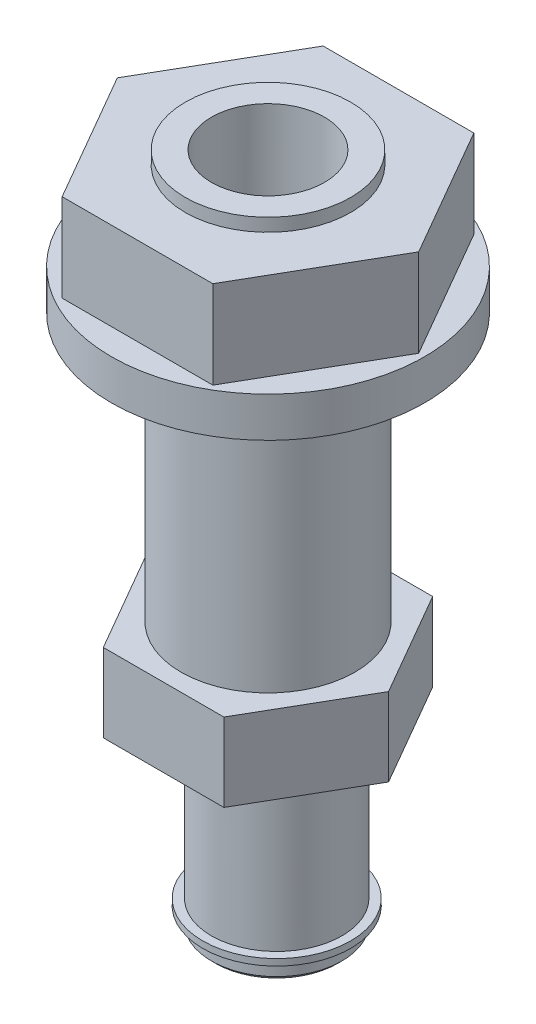
ISO-10303-21;
HEADER;
FILE_DESCRIPTION(('STEP AP214'),'2;1');
FILE_NAME('part.step','',(''),(''),'','','');
FILE_SCHEMA(('AUTOMOTIVE_DESIGN { 1 0 10303 214 1 1 1 1 }'));
ENDSEC;
DATA;
#1=APPLICATION_CONTEXT('core data for automotive mechanical design processes');
#2=APPLICATION_PROTOCOL_DEFINITION('international standard','automotive_design',2000,#1);
#3=PRODUCT_CONTEXT('',#1,'mechanical');
#4=PRODUCT('Part','Part','',(#3));
#5=PRODUCT_RELATED_PRODUCT_CATEGORY('part','',(#4));
#6=PRODUCT_DEFINITION_FORMATION('','',#4);
#7=PRODUCT_DEFINITION_CONTEXT('part definition',#1,'design');
#8=PRODUCT_DEFINITION('design','',#6,#7);
#9=PRODUCT_DEFINITION_SHAPE('','',#8);
#10=(LENGTH_UNIT() NAMED_UNIT(*) SI_UNIT(.MILLI.,.METRE.));
#11=(NAMED_UNIT(*) PLANE_ANGLE_UNIT() SI_UNIT($,.RADIAN.));
#12=(NAMED_UNIT(*) SI_UNIT($,.STERADIAN.) SOLID_ANGLE_UNIT());
#13=UNCERTAINTY_MEASURE_WITH_UNIT(LENGTH_MEASURE(1.E-05),#10,'distance_accuracy_value','');
#14=(GEOMETRIC_REPRESENTATION_CONTEXT(3) GLOBAL_UNCERTAINTY_ASSIGNED_CONTEXT((#13)) GLOBAL_UNIT_ASSIGNED_CONTEXT((#10,
#11,#12)) REPRESENTATION_CONTEXT('',''));
#15=CARTESIAN_POINT('',(0.,0.,0.));
#16=DIRECTION('',(0.,0.,1.));
#17=DIRECTION('',(1.,0.,0.));
#18=AXIS2_PLACEMENT_3D('',#15,#16,#17);
#19=CARTESIAN_POINT('',(-18.3343741873701,44.4,18.));
#20=DIRECTION('',(0.,1.,0.));
#21=DIRECTION('',(1.,0.,0.));
#22=AXIS2_PLACEMENT_3D('',#19,#20,#21);
#23=PLANE('',#22);
#24=CARTESIAN_POINT('',(0.,44.4,0.));
#25=DIRECTION('',(0.,1.,0.));
#26=DIRECTION('',(0.,0.,-1.));
#27=AXIS2_PLACEMENT_3D('',#24,#25,#26);
#28=CIRCLE('',#27,18.);
#29=CARTESIAN_POINT('',(0.,44.4,-18.));
#30=VERTEX_POINT('',#29);
#31=EDGE_CURVE('E128',#30,#30,#28,.F.);
#32=ORIENTED_EDGE('',*,*,#31,.F.);
#33=EDGE_LOOP('',(#32));
#34=FACE_BOUND('',#33,.T.);
#35=DIRECTION('',(0.500000000000009,0.,-0.866025403784433));
#36=VECTOR('',#35,1.);
#37=CARTESIAN_POINT('',(-17.320508075689,44.4,0.));
#38=LINE('',#37,#36);
#39=CARTESIAN_POINT('',(-8.6602540378444,44.4,-15.));
#40=VERTEX_POINT('',#39);
#41=CARTESIAN_POINT('',(-17.320508075689,44.4,0.));
#42=VERTEX_POINT('',#41);
#43=EDGE_CURVE('E114',#40,#42,#38,.F.);
#44=ORIENTED_EDGE('',*,*,#43,.F.);
#45=DIRECTION('',(1.,0.,0.));
#46=VECTOR('',#45,1.);
#47=CARTESIAN_POINT('',(-8.6602540378444,44.4,-15.));
#48=LINE('',#47,#46);
#49=CARTESIAN_POINT('',(8.66025403784441,44.4,-15.));
#50=VERTEX_POINT('',#49);
#51=EDGE_CURVE('E103',#50,#40,#48,.F.);
#52=ORIENTED_EDGE('',*,*,#51,.F.);
#53=DIRECTION('',(0.50000000000001,0.,0.866025403784433));
#54=VECTOR('',#53,1.);
#55=CARTESIAN_POINT('',(8.6602540378444,44.4,-15.));
#56=LINE('',#55,#54);
#57=CARTESIAN_POINT('',(17.320508075689,44.4,0.));
#58=VERTEX_POINT('',#57);
#59=EDGE_CURVE('E113',#58,#50,#56,.F.);
#60=ORIENTED_EDGE('',*,*,#59,.F.);
#61=DIRECTION('',(-0.500000000000009,0.,0.866025403784433));
#62=VECTOR('',#61,1.);
#63=CARTESIAN_POINT('',(17.320508075689,44.4,0.));
#64=LINE('',#63,#62);
#65=CARTESIAN_POINT('',(8.6602540378444,44.4,15.));
#66=VERTEX_POINT('',#65);
#67=EDGE_CURVE('E138',#66,#58,#64,.F.);
#68=ORIENTED_EDGE('',*,*,#67,.F.);
#69=DIRECTION('',(-1.,0.,0.));
#70=VECTOR('',#69,1.);
#71=CARTESIAN_POINT('',(8.6602540378444,44.4,15.));
#72=LINE('',#71,#70);
#73=CARTESIAN_POINT('',(-8.6602540378444,44.4,15.));
#74=VERTEX_POINT('',#73);
#75=EDGE_CURVE('E143',#74,#66,#72,.F.);
#76=ORIENTED_EDGE('',*,*,#75,.F.);
#77=DIRECTION('',(-0.500000000000009,0.,-0.866025403784433));
#78=VECTOR('',#77,1.);
#79=CARTESIAN_POINT('',(-8.6602540378444,44.4,15.));
#80=LINE('',#79,#78);
#81=EDGE_CURVE('E127',#42,#74,#80,.F.);
#82=ORIENTED_EDGE('',*,*,#81,.F.);
#83=EDGE_LOOP('',(#44,#52,#60,#68,#76,#82));
#84=FACE_BOUND('',#83,.T.);
#85=ADVANCED_FACE('F16',(#34,#84),#23,.T.);
#86=CARTESIAN_POINT('',(-13.856406460551,0.,0.));
#87=DIRECTION('',(-0.866025403784439,0.,-0.5));
#88=DIRECTION('',(0.,1.,0.));
#89=AXIS2_PLACEMENT_3D('',#86,#87,#88);
#90=PLANE('',#89);
#91=DIRECTION('',(-0.5,0.,0.866025403784439));
#92=VECTOR('',#91,1.);
#93=CARTESIAN_POINT('',(-6.9282032302755,0.,-12.));
#94=LINE('',#93,#92);
#95=CARTESIAN_POINT('',(-6.9282032302755,0.,-12.));
#96=VERTEX_POINT('',#95);
#97=CARTESIAN_POINT('',(-13.856406460551,0.,0.));
#98=VERTEX_POINT('',#97);
#99=EDGE_CURVE('E151',#96,#98,#94,.T.);
#100=ORIENTED_EDGE('',*,*,#99,.T.);
#101=DIRECTION('',(0.,1.,0.));
#102=VECTOR('',#101,1.);
#103=CARTESIAN_POINT('',(-13.856406460551,0.,0.));
#104=LINE('',#103,#102);
#105=CARTESIAN_POINT('',(-13.856406460551,9.,0.));
#106=VERTEX_POINT('',#105);
#107=EDGE_CURVE('E156',#106,#98,#104,.F.);
#108=ORIENTED_EDGE('',*,*,#107,.F.);
#109=DIRECTION('',(0.5,0.,-0.866025403784439));
#110=VECTOR('',#109,1.);
#111=CARTESIAN_POINT('',(-13.856406460551,9.,0.));
#112=LINE('',#111,#110);
#113=CARTESIAN_POINT('',(-6.9282032302755,9.,-12.));
#114=VERTEX_POINT('',#113);
#115=EDGE_CURVE('E161',#114,#106,#112,.F.);
#116=ORIENTED_EDGE('',*,*,#115,.F.);
#117=DIRECTION('',(0.,-1.,0.));
#118=VECTOR('',#117,1.);
#119=CARTESIAN_POINT('',(-6.9282032302755,9.,-12.));
#120=LINE('',#119,#118);
#121=EDGE_CURVE('E165',#114,#96,#120,.T.);
#122=ORIENTED_EDGE('',*,*,#121,.T.);
#123=EDGE_LOOP('',(#100,#108,#116,#122));
#124=FACE_BOUND('',#123,.T.);
#125=ADVANCED_FACE('F344',(#124),#90,.T.);
#126=CARTESIAN_POINT('',(-6.9282032302755,0.,12.));
#127=DIRECTION('',(-0.866025403784439,0.,0.5));
#128=DIRECTION('',(0.,1.,0.));
#129=AXIS2_PLACEMENT_3D('',#126,#127,#128);
#130=PLANE('',#129);
#131=DIRECTION('',(0.5,0.,0.866025403784439));
#132=VECTOR('',#131,1.);
#133=CARTESIAN_POINT('',(-13.856406460551,0.,0.));
#134=LINE('',#133,#132);
#135=CARTESIAN_POINT('',(-6.9282032302755,0.,12.));
#136=VERTEX_POINT('',#135);
#137=EDGE_CURVE('E170',#98,#136,#134,.T.);
#138=ORIENTED_EDGE('',*,*,#137,.T.);
#139=DIRECTION('',(0.,1.,0.));
#140=VECTOR('',#139,1.);
#141=CARTESIAN_POINT('',(-6.9282032302755,0.,12.));
#142=LINE('',#141,#140);
#143=CARTESIAN_POINT('',(-6.9282032302755,9.,12.));
#144=VERTEX_POINT('',#143);
#145=EDGE_CURVE('E175',#144,#136,#142,.F.);
#146=ORIENTED_EDGE('',*,*,#145,.F.);
#147=DIRECTION('',(-0.5,0.,-0.866025403784439));
#148=VECTOR('',#147,1.);
#149=CARTESIAN_POINT('',(-6.9282032302755,9.,12.));
#150=LINE('',#149,#148);
#151=EDGE_CURVE('E180',#106,#144,#150,.F.);
#152=ORIENTED_EDGE('',*,*,#151,.F.);
#153=ORIENTED_EDGE('',*,*,#107,.T.);
#154=EDGE_LOOP('',(#138,#146,#152,#153));
#155=FACE_BOUND('',#154,.T.);
#156=ADVANCED_FACE('F350',(#155),#130,.T.);
#157=CARTESIAN_POINT('',(6.9282032302755,0.,12.));
#158=DIRECTION('',(0.,0.,1.));
#159=DIRECTION('',(0.,1.,0.));
#160=AXIS2_PLACEMENT_3D('',#157,#158,#159);
#161=PLANE('',#160);
#162=DIRECTION('',(1.,0.,0.));
#163=VECTOR('',#162,1.);
#164=CARTESIAN_POINT('',(-6.9282032302755,0.,12.));
#165=LINE('',#164,#163);
#166=CARTESIAN_POINT('',(6.9282032302755,0.,12.));
#167=VERTEX_POINT('',#166);
#168=EDGE_CURVE('E184',#136,#167,#165,.T.);
#169=ORIENTED_EDGE('',*,*,#168,.T.);
#170=DIRECTION('',(0.,1.,0.));
#171=VECTOR('',#170,1.);
#172=CARTESIAN_POINT('',(6.9282032302755,0.,12.));
#173=LINE('',#172,#171);
#174=CARTESIAN_POINT('',(6.9282032302755,9.,12.));
#175=VERTEX_POINT('',#174);
#176=EDGE_CURVE('E189',#175,#167,#173,.F.);
#177=ORIENTED_EDGE('',*,*,#176,.F.);
#178=DIRECTION('',(-1.,0.,0.));
#179=VECTOR('',#178,1.);
#180=CARTESIAN_POINT('',(6.9282032302755,9.,12.));
#181=LINE('',#180,#179);
#182=EDGE_CURVE('E194',#144,#175,#181,.F.);
#183=ORIENTED_EDGE('',*,*,#182,.F.);
#184=ORIENTED_EDGE('',*,*,#145,.T.);
#185=EDGE_LOOP('',(#169,#177,#183,#184));
#186=FACE_BOUND('',#185,.T.);
#187=ADVANCED_FACE('F357',(#186),#161,.T.);
#188=CARTESIAN_POINT('',(13.856406460551,0.,0.));
#189=DIRECTION('',(0.866025403784439,0.,0.5));
#190=DIRECTION('',(0.,1.,0.));
#191=AXIS2_PLACEMENT_3D('',#188,#189,#190);
#192=PLANE('',#191);
#193=DIRECTION('',(0.5,0.,-0.866025403784439));
#194=VECTOR('',#193,1.);
#195=CARTESIAN_POINT('',(6.9282032302755,0.,12.));
#196=LINE('',#195,#194);
#197=CARTESIAN_POINT('',(13.856406460551,0.,0.));
#198=VERTEX_POINT('',#197);
#199=EDGE_CURVE('E198',#167,#198,#196,.T.);
#200=ORIENTED_EDGE('',*,*,#199,.T.);
#201=DIRECTION('',(0.,1.,0.));
#202=VECTOR('',#201,1.);
#203=CARTESIAN_POINT('',(13.856406460551,0.,0.));
#204=LINE('',#203,#202);
#205=CARTESIAN_POINT('',(13.856406460551,9.,0.));
#206=VERTEX_POINT('',#205);
#207=EDGE_CURVE('E203',#206,#198,#204,.F.);
#208=ORIENTED_EDGE('',*,*,#207,.F.);
#209=DIRECTION('',(-0.5,0.,0.866025403784439));
#210=VECTOR('',#209,1.);
#211=CARTESIAN_POINT('',(13.856406460551,9.,0.));
#212=LINE('',#211,#210);
#213=EDGE_CURVE('E208',#175,#206,#212,.F.);
#214=ORIENTED_EDGE('',*,*,#213,.F.);
#215=ORIENTED_EDGE('',*,*,#176,.T.);
#216=EDGE_LOOP('',(#200,#208,#214,#215));
#217=FACE_BOUND('',#216,.T.);
#218=ADVANCED_FACE('F361',(#217),#192,.T.);
#219=CARTESIAN_POINT('',(6.9282032302755,0.,-12.));
#220=DIRECTION('',(0.866025403784439,0.,-0.5));
#221=DIRECTION('',(0.,1.,0.));
#222=AXIS2_PLACEMENT_3D('',#219,#220,#221);
#223=PLANE('',#222);
#224=DIRECTION('',(-0.5,0.,-0.866025403784439));
#225=VECTOR('',#224,1.);
#226=CARTESIAN_POINT('',(13.856406460551,0.,0.));
#227=LINE('',#226,#225);
#228=CARTESIAN_POINT('',(6.9282032302755,0.,-12.));
#229=VERTEX_POINT('',#228);
#230=EDGE_CURVE('E212',#198,#229,#227,.T.);
#231=ORIENTED_EDGE('',*,*,#230,.T.);
#232=DIRECTION('',(0.,1.,0.));
#233=VECTOR('',#232,1.);
#234=CARTESIAN_POINT('',(6.9282032302755,0.,-12.));
#235=LINE('',#234,#233);
#236=CARTESIAN_POINT('',(6.9282032302755,9.,-12.));
#237=VERTEX_POINT('',#236);
#238=EDGE_CURVE('E217',#237,#229,#235,.F.);
#239=ORIENTED_EDGE('',*,*,#238,.F.);
#240=DIRECTION('',(0.5,0.,0.866025403784439));
#241=VECTOR('',#240,1.);
#242=CARTESIAN_POINT('',(6.9282032302755,9.,-12.));
#243=LINE('',#242,#241);
#244=EDGE_CURVE('E222',#206,#237,#243,.F.);
#245=ORIENTED_EDGE('',*,*,#244,.F.);
#246=ORIENTED_EDGE('',*,*,#207,.T.);
#247=EDGE_LOOP('',(#231,#239,#245,#246));
#248=FACE_BOUND('',#247,.T.);
#249=ADVANCED_FACE('F365',(#248),#223,.T.);
#250=CARTESIAN_POINT('',(-6.9282032302755,0.,-12.));
#251=DIRECTION('',(0.,0.,-1.));
#252=DIRECTION('',(0.,1.,0.));
#253=AXIS2_PLACEMENT_3D('',#250,#251,#252);
#254=PLANE('',#253);
#255=DIRECTION('',(-1.,0.,0.));
#256=VECTOR('',#255,1.);
#257=CARTESIAN_POINT('',(6.9282032302755,0.,-12.));
#258=LINE('',#257,#256);
#259=EDGE_CURVE('E226',#229,#96,#258,.T.);
#260=ORIENTED_EDGE('',*,*,#259,.T.);
#261=ORIENTED_EDGE('',*,*,#121,.F.);
#262=DIRECTION('',(1.,0.,0.));
#263=VECTOR('',#262,1.);
#264=CARTESIAN_POINT('',(-6.9282032302755,9.,-12.));
#265=LINE('',#264,#263);
#266=EDGE_CURVE('E231',#237,#114,#265,.F.);
#267=ORIENTED_EDGE('',*,*,#266,.F.);
#268=ORIENTED_EDGE('',*,*,#238,.T.);
#269=EDGE_LOOP('',(#260,#261,#267,#268));
#270=FACE_BOUND('',#269,.T.);
#271=ADVANCED_FACE('F369',(#270),#254,.T.);
#272=CARTESIAN_POINT('',(-13.856406460551,9.,-12.));
#273=DIRECTION('',(0.,1.,0.));
#274=DIRECTION('',(0.,0.,1.));
#275=AXIS2_PLACEMENT_3D('',#272,#273,#274);
#276=PLANE('',#275);
#277=ORIENTED_EDGE('',*,*,#115,.T.);
#278=ORIENTED_EDGE('',*,*,#151,.T.);
#279=ORIENTED_EDGE('',*,*,#182,.T.);
#280=ORIENTED_EDGE('',*,*,#213,.T.);
#281=ORIENTED_EDGE('',*,*,#244,.T.);
#282=ORIENTED_EDGE('',*,*,#266,.T.);
#283=EDGE_LOOP('',(#277,#278,#279,#280,#281,#282));
#284=FACE_BOUND('',#283,.T.);
#285=CARTESIAN_POINT('',(0.,9.,0.));
#286=DIRECTION('',(0.,-1.,0.));
#287=DIRECTION('',(0.,0.,1.));
#288=AXIS2_PLACEMENT_3D('',#285,#286,#287);
#289=CIRCLE('',#288,10.);
#290=CARTESIAN_POINT('',(0.,9.,10.));
#291=VERTEX_POINT('',#290);
#292=EDGE_CURVE('E235',#291,#291,#289,.T.);
#293=ORIENTED_EDGE('',*,*,#292,.T.);
#294=EDGE_LOOP('',(#293));
#295=FACE_BOUND('',#294,.T.);
#296=ADVANCED_FACE('F373',(#284,#295),#276,.T.);
#297=CARTESIAN_POINT('',(-13.856406460551,0.,-12.));
#298=DIRECTION('',(0.,-1.,0.));
#299=DIRECTION('',(1.,0.,0.));
#300=AXIS2_PLACEMENT_3D('',#297,#298,#299);
#301=PLANE('',#300);
#302=ORIENTED_EDGE('',*,*,#99,.F.);
#303=ORIENTED_EDGE('',*,*,#259,.F.);
#304=ORIENTED_EDGE('',*,*,#230,.F.);
#305=ORIENTED_EDGE('',*,*,#199,.F.);
#306=ORIENTED_EDGE('',*,*,#168,.F.);
#307=ORIENTED_EDGE('',*,*,#137,.F.);
#308=EDGE_LOOP('',(#302,#303,#304,#305,#306,#307));
#309=FACE_BOUND('',#308,.T.);
#310=CARTESIAN_POINT('',(1.,0.,0.));
#311=DIRECTION('',(0.,1.,0.));
#312=DIRECTION('',(0.,0.,-1.));
#313=AXIS2_PLACEMENT_3D('',#310,#311,#312);
#314=CIRCLE('',#313,7.5);
#315=CARTESIAN_POINT('',(1.,0.,-7.5));
#316=VERTEX_POINT('',#315);
#317=EDGE_CURVE('E240',#316,#316,#314,.F.);
#318=ORIENTED_EDGE('',*,*,#317,.F.);
#319=EDGE_LOOP('',(#318));
#320=FACE_BOUND('',#319,.T.);
#321=ADVANCED_FACE('F377',(#309,#320),#301,.T.);
#322=CARTESIAN_POINT('',(-18.3343741873701,39.8,-18.));
#323=DIRECTION('',(0.,-1.,0.));
#324=DIRECTION('',(1.,0.,0.));
#325=AXIS2_PLACEMENT_3D('',#322,#323,#324);
#326=PLANE('',#325);
#327=CARTESIAN_POINT('',(0.,39.8,0.));
#328=DIRECTION('',(0.,-1.,0.));
#329=DIRECTION('',(0.,0.,1.));
#330=AXIS2_PLACEMENT_3D('',#327,#328,#329);
#331=CIRCLE('',#330,18.);
#332=CARTESIAN_POINT('',(0.,39.8,18.));
#333=VERTEX_POINT('',#332);
#334=EDGE_CURVE('E243',#333,#333,#331,.T.);
#335=ORIENTED_EDGE('',*,*,#334,.T.);
#336=EDGE_LOOP('',(#335));
#337=FACE_BOUND('',#336,.T.);
#338=CARTESIAN_POINT('',(0.,39.8,0.));
#339=DIRECTION('',(0.,1.,0.));
#340=DIRECTION('',(0.,0.,-1.));
#341=AXIS2_PLACEMENT_3D('',#338,#339,#340);
#342=CIRCLE('',#341,10.);
#343=CARTESIAN_POINT('',(0.,39.8,-10.));
#344=VERTEX_POINT('',#343);
#345=EDGE_CURVE('E246',#344,#344,#342,.F.);
#346=ORIENTED_EDGE('',*,*,#345,.F.);
#347=EDGE_LOOP('',(#346));
#348=FACE_BOUND('',#347,.T.);
#349=ADVANCED_FACE('F381',(#337,#348),#326,.T.);
#350=CARTESIAN_POINT('',(-17.320508075689,44.4,0.));
#351=DIRECTION('',(-0.866025403784434,0.,-0.500000000000009));
#352=DIRECTION('',(0.,1.,0.));
#353=AXIS2_PLACEMENT_3D('',#350,#351,#352);
#354=PLANE('',#353);
#355=ORIENTED_EDGE('',*,*,#43,.T.);
#356=DIRECTION('',(0.,1.,0.));
#357=VECTOR('',#356,1.);
#358=CARTESIAN_POINT('',(-17.320508075689,44.4,0.));
#359=LINE('',#358,#357);
#360=CARTESIAN_POINT('',(-17.320508075689,54.5,0.));
#361=VERTEX_POINT('',#360);
#362=EDGE_CURVE('E249',#361,#42,#359,.F.);
#363=ORIENTED_EDGE('',*,*,#362,.F.);
#364=DIRECTION('',(0.500000000000009,0.,-0.866025403784434));
#365=VECTOR('',#364,1.);
#366=CARTESIAN_POINT('',(-17.320508075689,54.5,0.));
#367=LINE('',#366,#365);
#368=CARTESIAN_POINT('',(-8.6602540378444,54.5,-15.));
#369=VERTEX_POINT('',#368);
#370=EDGE_CURVE('E121',#369,#361,#367,.F.);
#371=ORIENTED_EDGE('',*,*,#370,.F.);
#372=DIRECTION('',(0.,-1.,0.));
#373=VECTOR('',#372,1.);
#374=CARTESIAN_POINT('',(-8.6602540378444,54.5,-15.));
#375=LINE('',#374,#373);
#376=EDGE_CURVE('E106',#369,#40,#375,.T.);
#377=ORIENTED_EDGE('',*,*,#376,.T.);
#378=EDGE_LOOP('',(#355,#363,#371,#377));
#379=FACE_BOUND('',#378,.T.);
#380=ADVANCED_FACE('F119',(#379),#354,.T.);
#381=CARTESIAN_POINT('',(-8.66025403784441,44.4,15.));
#382=DIRECTION('',(-0.866025403784434,0.,0.500000000000009));
#383=DIRECTION('',(0.,1.,0.));
#384=AXIS2_PLACEMENT_3D('',#381,#382,#383);
#385=PLANE('',#384);
#386=ORIENTED_EDGE('',*,*,#81,.T.);
#387=DIRECTION('',(0.,1.,0.));
#388=VECTOR('',#387,1.);
#389=CARTESIAN_POINT('',(-8.66025403784441,44.4,15.));
#390=LINE('',#389,#388);
#391=CARTESIAN_POINT('',(-8.66025403784441,54.5,15.));
#392=VERTEX_POINT('',#391);
#393=EDGE_CURVE('E122',#392,#74,#390,.F.);
#394=ORIENTED_EDGE('',*,*,#393,.F.);
#395=DIRECTION('',(-0.500000000000009,0.,-0.866025403784434));
#396=VECTOR('',#395,1.);
#397=CARTESIAN_POINT('',(-8.66025403784441,54.5,15.));
#398=LINE('',#397,#396);
#399=EDGE_CURVE('E259',#361,#392,#398,.F.);
#400=ORIENTED_EDGE('',*,*,#399,.F.);
#401=ORIENTED_EDGE('',*,*,#362,.T.);
#402=EDGE_LOOP('',(#386,#394,#400,#401));
#403=FACE_BOUND('',#402,.T.);
#404=ADVANCED_FACE('F388',(#403),#385,.T.);
#405=CARTESIAN_POINT('',(8.6602540378444,44.4,15.));
#406=DIRECTION('',(0.,0.,1.));
#407=DIRECTION('',(0.,1.,0.));
#408=AXIS2_PLACEMENT_3D('',#405,#406,#407);
#409=PLANE('',#408);
#410=ORIENTED_EDGE('',*,*,#75,.T.);
#411=DIRECTION('',(0.,1.,0.));
#412=VECTOR('',#411,1.);
#413=CARTESIAN_POINT('',(8.6602540378444,44.4,15.));
#414=LINE('',#413,#412);
#415=CARTESIAN_POINT('',(8.6602540378444,54.5,15.));
#416=VERTEX_POINT('',#415);
#417=EDGE_CURVE('E263',#416,#66,#414,.F.);
#418=ORIENTED_EDGE('',*,*,#417,.F.);
#419=DIRECTION('',(-1.,0.,0.));
#420=VECTOR('',#419,1.);
#421=CARTESIAN_POINT('',(8.6602540378444,54.5,15.));
#422=LINE('',#421,#420);
#423=EDGE_CURVE('E267',#392,#416,#422,.F.);
#424=ORIENTED_EDGE('',*,*,#423,.F.);
#425=ORIENTED_EDGE('',*,*,#393,.T.);
#426=EDGE_LOOP('',(#410,#418,#424,#425));
#427=FACE_BOUND('',#426,.T.);
#428=ADVANCED_FACE('F391',(#427),#409,.T.);
#429=CARTESIAN_POINT('',(17.320508075689,44.4,0.));
#430=DIRECTION('',(0.866025403784434,0.,0.500000000000009));
#431=DIRECTION('',(0.,1.,0.));
#432=AXIS2_PLACEMENT_3D('',#429,#430,#431);
#433=PLANE('',#432);
#434=ORIENTED_EDGE('',*,*,#67,.T.);
#435=DIRECTION('',(0.,1.,0.));
#436=VECTOR('',#435,1.);
#437=CARTESIAN_POINT('',(17.320508075689,44.4,0.));
#438=LINE('',#437,#436);
#439=CARTESIAN_POINT('',(17.320508075689,54.5,0.));
#440=VERTEX_POINT('',#439);
#441=EDGE_CURVE('E271',#440,#58,#438,.F.);
#442=ORIENTED_EDGE('',*,*,#441,.F.);
#443=DIRECTION('',(-0.500000000000009,0.,0.866025403784434));
#444=VECTOR('',#443,1.);
#445=CARTESIAN_POINT('',(17.320508075689,54.5,0.));
#446=LINE('',#445,#444);
#447=EDGE_CURVE('E36',#416,#440,#446,.F.);
#448=ORIENTED_EDGE('',*,*,#447,.F.);
#449=ORIENTED_EDGE('',*,*,#417,.T.);
#450=EDGE_LOOP('',(#434,#442,#448,#449));
#451=FACE_BOUND('',#450,.T.);
#452=ADVANCED_FACE('F395',(#451),#433,.T.);
#453=CARTESIAN_POINT('',(8.66025403784441,44.4,-15.));
#454=DIRECTION('',(0.866025403784434,0.,-0.500000000000009));
#455=DIRECTION('',(0.,1.,0.));
#456=AXIS2_PLACEMENT_3D('',#453,#454,#455);
#457=PLANE('',#456);
#458=ORIENTED_EDGE('',*,*,#59,.T.);
#459=DIRECTION('',(0.,1.,0.));
#460=VECTOR('',#459,1.);
#461=CARTESIAN_POINT('',(8.66025403784441,44.4,-15.));
#462=LINE('',#461,#460);
#463=CARTESIAN_POINT('',(8.66025403784441,54.5,-15.));
#464=VERTEX_POINT('',#463);
#465=EDGE_CURVE('E108',#464,#50,#462,.F.);
#466=ORIENTED_EDGE('',*,*,#465,.F.);
#467=DIRECTION('',(0.500000000000009,0.,0.866025403784434));
#468=VECTOR('',#467,1.);
#469=CARTESIAN_POINT('',(8.66025403784441,54.5,-15.));
#470=LINE('',#469,#468);
#471=EDGE_CURVE('E31',#440,#464,#470,.F.);
#472=ORIENTED_EDGE('',*,*,#471,.F.);
#473=ORIENTED_EDGE('',*,*,#441,.T.);
#474=EDGE_LOOP('',(#458,#466,#472,#473));
#475=FACE_BOUND('',#474,.T.);
#476=ADVANCED_FACE('F399',(#475),#457,.T.);
#477=CARTESIAN_POINT('',(-8.6602540378444,44.4,-15.));
#478=DIRECTION('',(0.,0.,-1.));
#479=DIRECTION('',(0.,1.,0.));
#480=AXIS2_PLACEMENT_3D('',#477,#478,#479);
#481=PLANE('',#480);
#482=ORIENTED_EDGE('',*,*,#51,.T.);
#483=ORIENTED_EDGE('',*,*,#376,.F.);
#484=DIRECTION('',(1.,0.,0.));
#485=VECTOR('',#484,1.);
#486=CARTESIAN_POINT('',(-8.6602540378444,54.5,-15.));
#487=LINE('',#486,#485);
#488=EDGE_CURVE('E284',#464,#369,#487,.F.);
#489=ORIENTED_EDGE('',*,*,#488,.F.);
#490=ORIENTED_EDGE('',*,*,#465,.T.);
#491=EDGE_LOOP('',(#482,#483,#489,#490));
#492=FACE_BOUND('',#491,.T.);
#493=ADVANCED_FACE('F105',(#492),#481,.T.);
#494=CARTESIAN_POINT('',(-17.320508075689,54.5,-15.));
#495=DIRECTION('',(0.,1.,0.));
#496=DIRECTION('',(0.,0.,1.));
#497=AXIS2_PLACEMENT_3D('',#494,#495,#496);
#498=PLANE('',#497);
#499=ORIENTED_EDGE('',*,*,#370,.T.);
#500=ORIENTED_EDGE('',*,*,#399,.T.);
#501=ORIENTED_EDGE('',*,*,#423,.T.);
#502=ORIENTED_EDGE('',*,*,#447,.T.);
#503=ORIENTED_EDGE('',*,*,#471,.T.);
#504=ORIENTED_EDGE('',*,*,#488,.T.);
#505=EDGE_LOOP('',(#499,#500,#501,#502,#503,#504));
#506=FACE_BOUND('',#505,.T.);
#507=CARTESIAN_POINT('',(0.,54.5,0.));
#508=DIRECTION('',(0.,-1.,0.));
#509=DIRECTION('',(0.,0.,1.));
#510=AXIS2_PLACEMENT_3D('',#507,#508,#509);
#511=CIRCLE('',#510,9.5);
#512=CARTESIAN_POINT('',(0.,54.5,9.5));
#513=VERTEX_POINT('',#512);
#514=EDGE_CURVE('E288',#513,#513,#511,.F.);
#515=ORIENTED_EDGE('',*,*,#514,.F.);
#516=EDGE_LOOP('',(#515));
#517=FACE_BOUND('',#516,.T.);
#518=ADVANCED_FACE('F406',(#506,#517),#498,.T.);
#519=CARTESIAN_POINT('',(-9.75957759775868,56.,9.5));
#520=DIRECTION('',(0.,1.,0.));
#521=DIRECTION('',(1.,0.,0.));
#522=AXIS2_PLACEMENT_3D('',#519,#520,#521);
#523=PLANE('',#522);
#524=CARTESIAN_POINT('',(0.,56.,0.));
#525=DIRECTION('',(0.,1.,0.));
#526=DIRECTION('',(0.,0.,-1.));
#527=AXIS2_PLACEMENT_3D('',#524,#525,#526);
#528=CIRCLE('',#527,9.5);
#529=CARTESIAN_POINT('',(0.,56.,-9.5));
#530=VERTEX_POINT('',#529);
#531=EDGE_CURVE('E293',#530,#530,#528,.F.);
#532=ORIENTED_EDGE('',*,*,#531,.F.);
#533=EDGE_LOOP('',(#532));
#534=FACE_BOUND('',#533,.T.);
#535=CARTESIAN_POINT('',(0.,56.,0.));
#536=DIRECTION('',(0.,-1.,0.));
#537=DIRECTION('',(0.,0.,1.));
#538=AXIS2_PLACEMENT_3D('',#535,#536,#537);
#539=CIRCLE('',#538,6.5);
#540=CARTESIAN_POINT('',(0.,56.,6.5));
#541=VERTEX_POINT('',#540);
#542=EDGE_CURVE('E296',#541,#541,#539,.T.);
#543=ORIENTED_EDGE('',*,*,#542,.T.);
#544=EDGE_LOOP('',(#543));
#545=FACE_BOUND('',#544,.T.);
#546=ADVANCED_FACE('F409',(#534,#545),#523,.T.);
#547=CARTESIAN_POINT('',(-6.67760572478225,44.,-6.5));
#548=DIRECTION('',(0.,1.,0.));
#549=DIRECTION('',(0.,0.,1.));
#550=AXIS2_PLACEMENT_3D('',#547,#548,#549);
#551=PLANE('',#550);
#552=CARTESIAN_POINT('',(0.,44.,0.));
#553=DIRECTION('',(0.,1.,0.));
#554=DIRECTION('',(0.,0.,-1.));
#555=AXIS2_PLACEMENT_3D('',#552,#553,#554);
#556=CIRCLE('',#555,6.5);
#557=CARTESIAN_POINT('',(0.,44.,-6.5));
#558=VERTEX_POINT('',#557);
#559=EDGE_CURVE('E299',#558,#558,#556,.F.);
#560=ORIENTED_EDGE('',*,*,#559,.F.);
#561=EDGE_LOOP('',(#560));
#562=FACE_BOUND('',#561,.T.);
#563=ADVANCED_FACE('F340',(#562),#551,.T.);
#564=CARTESIAN_POINT('',(-7.73225364009987,-18.,8.5));
#565=DIRECTION('',(0.,1.,0.));
#566=DIRECTION('',(1.,0.,0.));
#567=AXIS2_PLACEMENT_3D('',#564,#565,#566);
#568=PLANE('',#567);
#569=CARTESIAN_POINT('',(1.,-18.,0.));
#570=DIRECTION('',(0.,1.,0.));
#571=DIRECTION('',(0.,0.,-1.));
#572=AXIS2_PLACEMENT_3D('',#569,#570,#571);
#573=CIRCLE('',#572,8.5);
#574=CARTESIAN_POINT('',(0.999999999999998,-18.,-8.5));
#575=VERTEX_POINT('',#574);
#576=EDGE_CURVE('E302',#575,#575,#573,.F.);
#577=ORIENTED_EDGE('',*,*,#576,.F.);
#578=EDGE_LOOP('',(#577));
#579=FACE_BOUND('',#578,.T.);
#580=CARTESIAN_POINT('',(1.,-18.,0.));
#581=DIRECTION('',(0.,-1.,0.));
#582=DIRECTION('',(0.,0.,1.));
#583=AXIS2_PLACEMENT_3D('',#580,#581,#582);
#584=CIRCLE('',#583,7.5);
#585=CARTESIAN_POINT('',(1.,-18.,7.5));
#586=VERTEX_POINT('',#585);
#587=EDGE_CURVE('E305',#586,#586,#584,.T.);
#588=ORIENTED_EDGE('',*,*,#587,.T.);
#589=EDGE_LOOP('',(#588));
#590=FACE_BOUND('',#589,.T.);
#591=ADVANCED_FACE('F330',(#579,#590),#568,.T.);
#592=CARTESIAN_POINT('',(-7.73225362560405,-18.75,-8.5));
#593=DIRECTION('',(0.,-1.,0.));
#594=DIRECTION('',(1.,0.,0.));
#595=AXIS2_PLACEMENT_3D('',#592,#593,#594);
#596=PLANE('',#595);
#597=CARTESIAN_POINT('',(1.,-18.75,0.));
#598=DIRECTION('',(0.,-1.,0.));
#599=DIRECTION('',(-1.1684209678218E-09,0.,1.));
#600=AXIS2_PLACEMENT_3D('',#597,#598,#599);
#601=CIRCLE('',#600,8.5);
#602=CARTESIAN_POINT('',(0.999999990068422,-18.75,8.5));
#603=VERTEX_POINT('',#602);
#604=EDGE_CURVE('E308',#603,#603,#601,.T.);
#605=ORIENTED_EDGE('',*,*,#604,.T.);
#606=EDGE_LOOP('',(#605));
#607=FACE_BOUND('',#606,.T.);
#608=CARTESIAN_POINT('',(1.,-18.75,0.));
#609=DIRECTION('',(0.,1.,0.));
#610=DIRECTION('',(0.,0.,-1.));
#611=AXIS2_PLACEMENT_3D('',#608,#609,#610);
#612=CIRCLE('',#611,7.5);
#613=CARTESIAN_POINT('',(1.,-18.75,-7.5));
#614=VERTEX_POINT('',#613);
#615=EDGE_CURVE('E311',#614,#614,#612,.F.);
#616=ORIENTED_EDGE('',*,*,#615,.F.);
#617=EDGE_LOOP('',(#616));
#618=FACE_BOUND('',#617,.T.);
#619=ADVANCED_FACE('F328',(#607,#618),#596,.T.);
#620=CARTESIAN_POINT('',(-6.19126770361165,-21.,-7.));
#621=DIRECTION('',(0.,-1.,0.));
#622=DIRECTION('',(1.,0.,0.));
#623=AXIS2_PLACEMENT_3D('',#620,#621,#622);
#624=PLANE('',#623);
#625=CARTESIAN_POINT('',(1.,-21.,0.));
#626=DIRECTION('',(0.,-1.,0.));
#627=DIRECTION('',(0.,0.,1.));
#628=AXIS2_PLACEMENT_3D('',#625,#626,#627);
#629=CIRCLE('',#628,7.);
#630=CARTESIAN_POINT('',(1.,-21.,7.));
#631=VERTEX_POINT('',#630);
#632=EDGE_CURVE('E24',#631,#631,#629,.T.);
#633=ORIENTED_EDGE('',*,*,#632,.T.);
#634=EDGE_LOOP('',(#633));
#635=FACE_BOUND('',#634,.T.);
#636=ADVANCED_FACE('F316',(#635),#624,.T.);
#637=CARTESIAN_POINT('',(0.,9.,0.));
#638=DIRECTION('',(0.,-1.,0.));
#639=DIRECTION('',(0.,0.,1.));
#640=AXIS2_PLACEMENT_3D('',#637,#638,#639);
#641=CYLINDRICAL_SURFACE('',#640,18.);
#642=ORIENTED_EDGE('',*,*,#334,.F.);
#643=EDGE_LOOP('',(#642));
#644=FACE_BOUND('',#643,.T.);
#645=ORIENTED_EDGE('',*,*,#31,.T.);
#646=EDGE_LOOP('',(#645));
#647=FACE_BOUND('',#646,.T.);
#648=ADVANCED_FACE('F338',(#644,#647),#641,.T.);
#649=CARTESIAN_POINT('',(0.,9.,0.));
#650=DIRECTION('',(0.,-1.,0.));
#651=DIRECTION('',(0.,0.,1.));
#652=AXIS2_PLACEMENT_3D('',#649,#650,#651);
#653=CYLINDRICAL_SURFACE('',#652,10.);
#654=ORIENTED_EDGE('',*,*,#292,.F.);
#655=EDGE_LOOP('',(#654));
#656=FACE_BOUND('',#655,.T.);
#657=ORIENTED_EDGE('',*,*,#345,.T.);
#658=EDGE_LOOP('',(#657));
#659=FACE_BOUND('',#658,.T.);
#660=ADVANCED_FACE('F433',(#656,#659),#653,.T.);
#661=CARTESIAN_POINT('',(0.,9.,0.));
#662=DIRECTION('',(0.,-1.,0.));
#663=DIRECTION('',(0.,0.,1.));
#664=AXIS2_PLACEMENT_3D('',#661,#662,#663);
#665=CYLINDRICAL_SURFACE('',#664,9.5);
#666=ORIENTED_EDGE('',*,*,#514,.T.);
#667=EDGE_LOOP('',(#666));
#668=FACE_BOUND('',#667,.T.);
#669=ORIENTED_EDGE('',*,*,#531,.T.);
#670=EDGE_LOOP('',(#669));
#671=FACE_BOUND('',#670,.T.);
#672=ADVANCED_FACE('F423',(#668,#671),#665,.T.);
#673=CARTESIAN_POINT('',(0.,44.,0.));
#674=DIRECTION('',(0.,-1.,0.));
#675=DIRECTION('',(0.,0.,1.));
#676=AXIS2_PLACEMENT_3D('',#673,#674,#675);
#677=CYLINDRICAL_SURFACE('',#676,6.5);
#678=ORIENTED_EDGE('',*,*,#559,.T.);
#679=EDGE_LOOP('',(#678));
#680=FACE_BOUND('',#679,.T.);
#681=ORIENTED_EDGE('',*,*,#542,.F.);
#682=EDGE_LOOP('',(#681));
#683=FACE_BOUND('',#682,.T.);
#684=ADVANCED_FACE('F419',(#680,#683),#677,.F.);
#685=CARTESIAN_POINT('',(1.,-21.,0.));
#686=DIRECTION('',(0.,-1.,0.));
#687=DIRECTION('',(1.16847832554876E-09,0.,1.));
#688=AXIS2_PLACEMENT_3D('',#685,#686,#687);
#689=CYLINDRICAL_SURFACE('',#688,7.5);
#690=ORIENTED_EDGE('',*,*,#587,.F.);
#691=EDGE_LOOP('',(#690));
#692=FACE_BOUND('',#691,.T.);
#693=ORIENTED_EDGE('',*,*,#317,.T.);
#694=EDGE_LOOP('',(#693));
#695=FACE_BOUND('',#694,.T.);
#696=ADVANCED_FACE('F422',(#692,#695),#689,.T.);
#697=CARTESIAN_POINT('',(1.,-21.,0.));
#698=DIRECTION('',(0.,-1.,0.));
#699=DIRECTION('',(0.,0.,1.));
#700=AXIS2_PLACEMENT_3D('',#697,#698,#699);
#701=CYLINDRICAL_SURFACE('',#700,8.5);
#702=ORIENTED_EDGE('',*,*,#604,.F.);
#703=EDGE_LOOP('',(#702));
#704=FACE_BOUND('',#703,.T.);
#705=ORIENTED_EDGE('',*,*,#576,.T.);
#706=EDGE_LOOP('',(#705));
#707=FACE_BOUND('',#706,.T.);
#708=ADVANCED_FACE('F325',(#704,#707),#701,.T.);
#709=CARTESIAN_POINT('',(1.,-21.,0.));
#710=DIRECTION('',(0.,-1.,0.));
#711=DIRECTION('',(0.,0.,1.));
#712=AXIS2_PLACEMENT_3D('',#709,#710,#711);
#713=CYLINDRICAL_SURFACE('',#712,7.5);
#714=CARTESIAN_POINT('',(1.,-20.5,0.));
#715=DIRECTION('',(0.,1.,0.));
#716=DIRECTION('',(0.,0.,-1.));
#717=AXIS2_PLACEMENT_3D('',#714,#715,#716);
#718=CIRCLE('',#717,7.5);
#719=CARTESIAN_POINT('',(0.999999999999998,-20.5,-7.5));
#720=VERTEX_POINT('',#719);
#721=EDGE_CURVE('E11',#720,#720,#718,.F.);
#722=ORIENTED_EDGE('',*,*,#721,.F.);
#723=EDGE_LOOP('',(#722));
#724=FACE_BOUND('',#723,.T.);
#725=ORIENTED_EDGE('',*,*,#615,.T.);
#726=EDGE_LOOP('',(#725));
#727=FACE_BOUND('',#726,.T.);
#728=ADVANCED_FACE('F320',(#724,#727),#713,.T.);
#729=CARTESIAN_POINT('',(1.,-20.5,0.));
#730=DIRECTION('',(0.,1.,0.));
#731=DIRECTION('',(0.,0.,-1.));
#732=AXIS2_PLACEMENT_3D('',#729,#730,#731);
#733=CONICAL_SURFACE('',#732,7.5,0.785398163397447);
#734=ORIENTED_EDGE('',*,*,#632,.F.);
#735=EDGE_LOOP('',(#734));
#736=FACE_BOUND('',#735,.T.);
#737=ORIENTED_EDGE('',*,*,#721,.T.);
#738=EDGE_LOOP('',(#737));
#739=FACE_BOUND('',#738,.T.);
#740=ADVANCED_FACE('F18',(#736,#739),#733,.T.);
#741=CLOSED_SHELL('',(#85,#125,#156,#187,#218,#249,#271,#296,#321,#349,#380,#404,#428,#452,#476,
#493,#518,#546,#563,#591,#619,#636,#648,#660,#672,#684,#696,#708,#728,#740));
#742=MANIFOLD_SOLID_BREP('B1',#741);
#743=ADVANCED_BREP_SHAPE_REPRESENTATION('',(#18,#742),#14);
#744=SHAPE_DEFINITION_REPRESENTATION(#9,#743);
ENDSEC;
END-ISO-10303-21;
